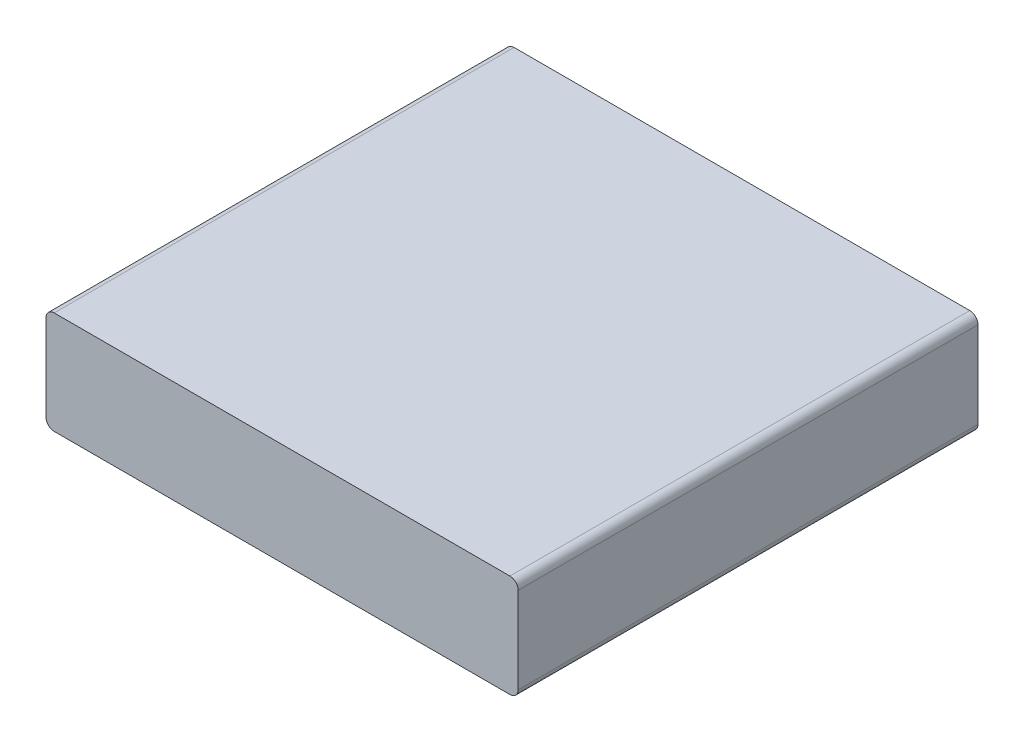
ISO-10303-21;
HEADER;
FILE_DESCRIPTION(('STEP AP214'),'2;1');
FILE_NAME('part.step','',(''),(''),'','','');
FILE_SCHEMA(('AUTOMOTIVE_DESIGN { 1 0 10303 214 1 1 1 1 }'));
ENDSEC;
DATA;
#1=APPLICATION_CONTEXT('core data for automotive mechanical design processes');
#2=APPLICATION_PROTOCOL_DEFINITION('international standard','automotive_design',2000,#1);
#3=PRODUCT_CONTEXT('',#1,'mechanical');
#4=PRODUCT('Part','Part','',(#3));
#5=PRODUCT_RELATED_PRODUCT_CATEGORY('part','',(#4));
#6=PRODUCT_DEFINITION_FORMATION('','',#4);
#7=PRODUCT_DEFINITION_CONTEXT('part definition',#1,'design');
#8=PRODUCT_DEFINITION('design','',#6,#7);
#9=PRODUCT_DEFINITION_SHAPE('','',#8);
#10=(LENGTH_UNIT() NAMED_UNIT(*) SI_UNIT(.MILLI.,.METRE.));
#11=(NAMED_UNIT(*) PLANE_ANGLE_UNIT() SI_UNIT($,.RADIAN.));
#12=(NAMED_UNIT(*) SI_UNIT($,.STERADIAN.) SOLID_ANGLE_UNIT());
#13=UNCERTAINTY_MEASURE_WITH_UNIT(LENGTH_MEASURE(1.E-05),#10,'distance_accuracy_value','');
#14=(GEOMETRIC_REPRESENTATION_CONTEXT(3) GLOBAL_UNCERTAINTY_ASSIGNED_CONTEXT((#13)) GLOBAL_UNIT_ASSIGNED_CONTEXT((#10,
#11,#12)) REPRESENTATION_CONTEXT('',''));
#15=CARTESIAN_POINT('',(0.,0.,0.));
#16=DIRECTION('',(0.,0.,1.));
#17=DIRECTION('',(1.,0.,0.));
#18=AXIS2_PLACEMENT_3D('',#15,#16,#17);
#19=CARTESIAN_POINT('',(-29.3402777777778,15.8854166666667,-112.));
#20=DIRECTION('',(-1.,0.,0.));
#21=DIRECTION('',(0.,0.,1.));
#22=AXIS2_PLACEMENT_3D('',#19,#20,#21);
#23=PLANE('',#22);
#24=DIRECTION('',(0.,-1.,0.));
#25=VECTOR('',#24,1.);
#26=CARTESIAN_POINT('',(-29.3402777777778,15.8854166666667,-112.));
#27=LINE('',#26,#25);
#28=CARTESIAN_POINT('',(-29.3402777777778,13.8854166666667,-112.));
#29=VERTEX_POINT('',#28);
#30=CARTESIAN_POINT('',(-29.3402777777778,-7.11458333333333,-112.));
#31=VERTEX_POINT('',#30);
#32=EDGE_CURVE('E179',#29,#31,#27,.T.);
#33=ORIENTED_EDGE('',*,*,#32,.T.);
#34=DIRECTION('',(0.,0.,1.));
#35=VECTOR('',#34,1.);
#36=CARTESIAN_POINT('',(-29.3402777777778,-7.11458333333333,-112.));
#37=LINE('',#36,#35);
#38=CARTESIAN_POINT('',(-29.3402777777778,-7.11458333333333,0.));
#39=VERTEX_POINT('',#38);
#40=EDGE_CURVE('E11',#31,#39,#37,.T.);
#41=ORIENTED_EDGE('',*,*,#40,.T.);
#42=DIRECTION('',(0.,-1.,0.));
#43=VECTOR('',#42,1.);
#44=CARTESIAN_POINT('',(-29.3402777777778,15.8854166666667,0.));
#45=LINE('',#44,#43);
#46=CARTESIAN_POINT('',(-29.3402777777778,13.8854166666667,0.));
#47=VERTEX_POINT('',#46);
#48=EDGE_CURVE('E112',#47,#39,#45,.T.);
#49=ORIENTED_EDGE('',*,*,#48,.F.);
#50=DIRECTION('',(0.,0.,1.));
#51=VECTOR('',#50,1.);
#52=CARTESIAN_POINT('',(-29.3402777777778,13.8854166666667,-112.));
#53=LINE('',#52,#51);
#54=EDGE_CURVE('E48',#47,#29,#53,.F.);
#55=ORIENTED_EDGE('',*,*,#54,.T.);
#56=EDGE_LOOP('',(#33,#41,#49,#55));
#57=FACE_BOUND('',#56,.T.);
#58=ADVANCED_FACE('F39',(#57),#23,.T.);
#59=CARTESIAN_POINT('',(-29.3402777777778,15.8854166666667,-112.));
#60=DIRECTION('',(0.,1.,0.));
#61=DIRECTION('',(0.,0.,1.));
#62=AXIS2_PLACEMENT_3D('',#59,#60,#61);
#63=PLANE('',#62);
#64=DIRECTION('',(-1.,0.,0.));
#65=VECTOR('',#64,1.);
#66=CARTESIAN_POINT('',(-29.3402777777778,15.8854166666667,0.));
#67=LINE('',#66,#65);
#68=CARTESIAN_POINT('',(83.6597222222222,15.8854166666667,0.));
#69=VERTEX_POINT('',#68);
#70=CARTESIAN_POINT('',(-27.3402777777778,15.8854166666667,0.));
#71=VERTEX_POINT('',#70);
#72=EDGE_CURVE('E143',#69,#71,#67,.T.);
#73=ORIENTED_EDGE('',*,*,#72,.F.);
#74=DIRECTION('',(0.,0.,1.));
#75=VECTOR('',#74,1.);
#76=CARTESIAN_POINT('',(83.6597222222222,15.8854166666667,-112.));
#77=LINE('',#76,#75);
#78=CARTESIAN_POINT('',(83.6597222222222,15.8854166666667,-112.));
#79=VERTEX_POINT('',#78);
#80=EDGE_CURVE('E62',#69,#79,#77,.F.);
#81=ORIENTED_EDGE('',*,*,#80,.T.);
#82=DIRECTION('',(-1.,0.,0.));
#83=VECTOR('',#82,1.);
#84=CARTESIAN_POINT('',(-29.3402777777778,15.8854166666667,-112.));
#85=LINE('',#84,#83);
#86=CARTESIAN_POINT('',(-27.3402777777778,15.8854166666667,-112.));
#87=VERTEX_POINT('',#86);
#88=EDGE_CURVE('E135',#79,#87,#85,.T.);
#89=ORIENTED_EDGE('',*,*,#88,.T.);
#90=DIRECTION('',(0.,0.,1.));
#91=VECTOR('',#90,1.);
#92=CARTESIAN_POINT('',(-27.3402777777778,15.8854166666667,-112.));
#93=LINE('',#92,#91);
#94=EDGE_CURVE('E170',#87,#71,#93,.T.);
#95=ORIENTED_EDGE('',*,*,#94,.T.);
#96=EDGE_LOOP('',(#73,#81,#89,#95));
#97=FACE_BOUND('',#96,.T.);
#98=ADVANCED_FACE('F188',(#97),#63,.T.);
#99=CARTESIAN_POINT('',(85.6597222222222,15.8854166666667,-112.));
#100=DIRECTION('',(1.,0.,0.));
#101=DIRECTION('',(0.,0.,-1.));
#102=AXIS2_PLACEMENT_3D('',#99,#100,#101);
#103=PLANE('',#102);
#104=DIRECTION('',(0.,1.,0.));
#105=VECTOR('',#104,1.);
#106=CARTESIAN_POINT('',(85.6597222222222,15.8854166666667,0.));
#107=LINE('',#106,#105);
#108=CARTESIAN_POINT('',(85.6597222222222,-7.11458333333333,0.));
#109=VERTEX_POINT('',#108);
#110=CARTESIAN_POINT('',(85.6597222222222,13.8854166666667,0.));
#111=VERTEX_POINT('',#110);
#112=EDGE_CURVE('E129',#109,#111,#107,.T.);
#113=ORIENTED_EDGE('',*,*,#112,.F.);
#114=DIRECTION('',(0.,0.,1.));
#115=VECTOR('',#114,1.);
#116=CARTESIAN_POINT('',(85.6597222222222,-7.11458333333333,-112.));
#117=LINE('',#116,#115);
#118=CARTESIAN_POINT('',(85.6597222222222,-7.11458333333333,-112.));
#119=VERTEX_POINT('',#118);
#120=EDGE_CURVE('E157',#109,#119,#117,.F.);
#121=ORIENTED_EDGE('',*,*,#120,.T.);
#122=DIRECTION('',(0.,1.,0.));
#123=VECTOR('',#122,1.);
#124=CARTESIAN_POINT('',(85.6597222222222,15.8854166666667,-112.));
#125=LINE('',#124,#123);
#126=CARTESIAN_POINT('',(85.6597222222222,13.8854166666667,-112.));
#127=VERTEX_POINT('',#126);
#128=EDGE_CURVE('E140',#119,#127,#125,.T.);
#129=ORIENTED_EDGE('',*,*,#128,.T.);
#130=DIRECTION('',(0.,0.,1.));
#131=VECTOR('',#130,1.);
#132=CARTESIAN_POINT('',(85.6597222222222,13.8854166666667,-112.));
#133=LINE('',#132,#131);
#134=EDGE_CURVE('E153',#127,#111,#133,.T.);
#135=ORIENTED_EDGE('',*,*,#134,.T.);
#136=EDGE_LOOP('',(#113,#121,#129,#135));
#137=FACE_BOUND('',#136,.T.);
#138=ADVANCED_FACE('F205',(#137),#103,.T.);
#139=CARTESIAN_POINT('',(-29.3402777777778,-9.11458333333333,-112.));
#140=DIRECTION('',(0.,-1.,0.));
#141=DIRECTION('',(0.,0.,-1.));
#142=AXIS2_PLACEMENT_3D('',#139,#140,#141);
#143=PLANE('',#142);
#144=DIRECTION('',(1.,0.,0.));
#145=VECTOR('',#144,1.);
#146=CARTESIAN_POINT('',(-29.3402777777778,-9.11458333333333,-112.));
#147=LINE('',#146,#145);
#148=CARTESIAN_POINT('',(-27.3402777777778,-9.11458333333333,-112.));
#149=VERTEX_POINT('',#148);
#150=CARTESIAN_POINT('',(83.6597222222222,-9.11458333333333,-112.));
#151=VERTEX_POINT('',#150);
#152=EDGE_CURVE('E184',#149,#151,#147,.T.);
#153=ORIENTED_EDGE('',*,*,#152,.T.);
#154=DIRECTION('',(0.,0.,1.));
#155=VECTOR('',#154,1.);
#156=CARTESIAN_POINT('',(83.6597222222222,-9.11458333333333,-112.));
#157=LINE('',#156,#155);
#158=CARTESIAN_POINT('',(83.6597222222222,-9.11458333333333,0.));
#159=VERTEX_POINT('',#158);
#160=EDGE_CURVE('E127',#151,#159,#157,.T.);
#161=ORIENTED_EDGE('',*,*,#160,.T.);
#162=DIRECTION('',(1.,0.,0.));
#163=VECTOR('',#162,1.);
#164=CARTESIAN_POINT('',(-29.3402777777778,-9.11458333333333,0.));
#165=LINE('',#164,#163);
#166=CARTESIAN_POINT('',(-27.3402777777778,-9.11458333333333,0.));
#167=VERTEX_POINT('',#166);
#168=EDGE_CURVE('E110',#167,#159,#165,.T.);
#169=ORIENTED_EDGE('',*,*,#168,.F.);
#170=DIRECTION('',(0.,0.,1.));
#171=VECTOR('',#170,1.);
#172=CARTESIAN_POINT('',(-27.3402777777778,-9.11458333333333,-112.));
#173=LINE('',#172,#171);
#174=EDGE_CURVE('E124',#167,#149,#173,.F.);
#175=ORIENTED_EDGE('',*,*,#174,.T.);
#176=EDGE_LOOP('',(#153,#161,#169,#175));
#177=FACE_BOUND('',#176,.T.);
#178=ADVANCED_FACE('F123',(#177),#143,.T.);
#179=CARTESIAN_POINT('',(0.,0.,-112.));
#180=DIRECTION('',(0.,0.,1.));
#181=DIRECTION('',(1.,0.,0.));
#182=AXIS2_PLACEMENT_3D('',#179,#180,#181);
#183=PLANE('',#182);
#184=ORIENTED_EDGE('',*,*,#128,.F.);
#185=CARTESIAN_POINT('',(83.6597222222222,-7.11458333333333,-112.));
#186=DIRECTION('',(0.,0.,1.));
#187=DIRECTION('',(1.,0.,0.));
#188=AXIS2_PLACEMENT_3D('',#185,#186,#187);
#189=CIRCLE('',#188,2.);
#190=EDGE_CURVE('E167',#119,#151,#189,.F.);
#191=ORIENTED_EDGE('',*,*,#190,.T.);
#192=ORIENTED_EDGE('',*,*,#152,.F.);
#193=CARTESIAN_POINT('',(-27.3402777777778,-7.11458333333333,-112.));
#194=DIRECTION('',(0.,0.,1.));
#195=DIRECTION('',(1.,0.,0.));
#196=AXIS2_PLACEMENT_3D('',#193,#194,#195);
#197=CIRCLE('',#196,2.);
#198=EDGE_CURVE('E133',#149,#31,#197,.F.);
#199=ORIENTED_EDGE('',*,*,#198,.T.);
#200=ORIENTED_EDGE('',*,*,#32,.F.);
#201=CARTESIAN_POINT('',(-27.3402777777778,13.8854166666667,-112.));
#202=DIRECTION('',(0.,0.,1.));
#203=DIRECTION('',(1.,0.,0.));
#204=AXIS2_PLACEMENT_3D('',#201,#202,#203);
#205=CIRCLE('',#204,2.);
#206=EDGE_CURVE('E55',#29,#87,#205,.F.);
#207=ORIENTED_EDGE('',*,*,#206,.T.);
#208=ORIENTED_EDGE('',*,*,#88,.F.);
#209=CARTESIAN_POINT('',(83.6597222222222,13.8854166666667,-112.));
#210=DIRECTION('',(0.,0.,1.));
#211=DIRECTION('',(1.,0.,0.));
#212=AXIS2_PLACEMENT_3D('',#209,#210,#211);
#213=CIRCLE('',#212,2.);
#214=EDGE_CURVE('E164',#79,#127,#213,.F.);
#215=ORIENTED_EDGE('',*,*,#214,.T.);
#216=EDGE_LOOP('',(#184,#191,#192,#199,#200,#207,#208,#215));
#217=FACE_BOUND('',#216,.T.);
#218=ADVANCED_FACE('F182',(#217),#183,.F.);
#219=CARTESIAN_POINT('',(0.,0.,0.));
#220=DIRECTION('',(0.,0.,1.));
#221=DIRECTION('',(1.,0.,0.));
#222=AXIS2_PLACEMENT_3D('',#219,#220,#221);
#223=PLANE('',#222);
#224=ORIENTED_EDGE('',*,*,#168,.T.);
#225=CARTESIAN_POINT('',(83.6597222222222,-7.11458333333333,0.));
#226=DIRECTION('',(0.,0.,1.));
#227=DIRECTION('',(1.,0.,0.));
#228=AXIS2_PLACEMENT_3D('',#225,#226,#227);
#229=CIRCLE('',#228,2.);
#230=EDGE_CURVE('E150',#159,#109,#229,.T.);
#231=ORIENTED_EDGE('',*,*,#230,.T.);
#232=ORIENTED_EDGE('',*,*,#112,.T.);
#233=CARTESIAN_POINT('',(83.6597222222222,13.8854166666667,0.));
#234=DIRECTION('',(0.,0.,1.));
#235=DIRECTION('',(1.,0.,0.));
#236=AXIS2_PLACEMENT_3D('',#233,#234,#235);
#237=CIRCLE('',#236,2.);
#238=EDGE_CURVE('E117',#111,#69,#237,.T.);
#239=ORIENTED_EDGE('',*,*,#238,.T.);
#240=ORIENTED_EDGE('',*,*,#72,.T.);
#241=CARTESIAN_POINT('',(-27.3402777777778,13.8854166666667,0.));
#242=DIRECTION('',(0.,0.,1.));
#243=DIRECTION('',(1.,0.,0.));
#244=AXIS2_PLACEMENT_3D('',#241,#242,#243);
#245=CIRCLE('',#244,2.);
#246=EDGE_CURVE('E118',#71,#47,#245,.T.);
#247=ORIENTED_EDGE('',*,*,#246,.T.);
#248=ORIENTED_EDGE('',*,*,#48,.T.);
#249=CARTESIAN_POINT('',(-27.3402777777778,-7.11458333333333,0.));
#250=DIRECTION('',(0.,0.,1.));
#251=DIRECTION('',(1.,0.,0.));
#252=AXIS2_PLACEMENT_3D('',#249,#250,#251);
#253=CIRCLE('',#252,2.);
#254=EDGE_CURVE('E107',#39,#167,#253,.T.);
#255=ORIENTED_EDGE('',*,*,#254,.T.);
#256=EDGE_LOOP('',(#224,#231,#232,#239,#240,#247,#248,#255));
#257=FACE_BOUND('',#256,.T.);
#258=ADVANCED_FACE('F109',(#257),#223,.T.);
#259=CARTESIAN_POINT('',(83.6597222222222,-7.11458333333333,-112.));
#260=DIRECTION('',(0.,0.,1.));
#261=DIRECTION('',(1.,0.,0.));
#262=AXIS2_PLACEMENT_3D('',#259,#260,#261);
#263=CYLINDRICAL_SURFACE('',#262,2.);
#264=ORIENTED_EDGE('',*,*,#190,.F.);
#265=ORIENTED_EDGE('',*,*,#120,.F.);
#266=ORIENTED_EDGE('',*,*,#230,.F.);
#267=ORIENTED_EDGE('',*,*,#160,.F.);
#268=EDGE_LOOP('',(#264,#265,#266,#267));
#269=FACE_BOUND('',#268,.T.);
#270=ADVANCED_FACE('F202',(#269),#263,.T.);
#271=CARTESIAN_POINT('',(83.6597222222222,13.8854166666667,-112.));
#272=DIRECTION('',(0.,0.,1.));
#273=DIRECTION('',(1.,0.,0.));
#274=AXIS2_PLACEMENT_3D('',#271,#272,#273);
#275=CYLINDRICAL_SURFACE('',#274,2.);
#276=ORIENTED_EDGE('',*,*,#214,.F.);
#277=ORIENTED_EDGE('',*,*,#80,.F.);
#278=ORIENTED_EDGE('',*,*,#238,.F.);
#279=ORIENTED_EDGE('',*,*,#134,.F.);
#280=EDGE_LOOP('',(#276,#277,#278,#279));
#281=FACE_BOUND('',#280,.T.);
#282=ADVANCED_FACE('F209',(#281),#275,.T.);
#283=CARTESIAN_POINT('',(-27.3402777777778,-7.11458333333333,-112.));
#284=DIRECTION('',(0.,0.,1.));
#285=DIRECTION('',(1.,0.,0.));
#286=AXIS2_PLACEMENT_3D('',#283,#284,#285);
#287=CYLINDRICAL_SURFACE('',#286,2.);
#288=ORIENTED_EDGE('',*,*,#198,.F.);
#289=ORIENTED_EDGE('',*,*,#174,.F.);
#290=ORIENTED_EDGE('',*,*,#254,.F.);
#291=ORIENTED_EDGE('',*,*,#40,.F.);
#292=EDGE_LOOP('',(#288,#289,#290,#291));
#293=FACE_BOUND('',#292,.T.);
#294=ADVANCED_FACE('F132',(#293),#287,.T.);
#295=CARTESIAN_POINT('',(-27.3402777777778,13.8854166666667,-112.));
#296=DIRECTION('',(0.,0.,1.));
#297=DIRECTION('',(1.,0.,0.));
#298=AXIS2_PLACEMENT_3D('',#295,#296,#297);
#299=CYLINDRICAL_SURFACE('',#298,2.);
#300=ORIENTED_EDGE('',*,*,#206,.F.);
#301=ORIENTED_EDGE('',*,*,#54,.F.);
#302=ORIENTED_EDGE('',*,*,#246,.F.);
#303=ORIENTED_EDGE('',*,*,#94,.F.);
#304=EDGE_LOOP('',(#300,#301,#302,#303));
#305=FACE_BOUND('',#304,.T.);
#306=ADVANCED_FACE('F41',(#305),#299,.T.);
#307=CLOSED_SHELL('',(#58,#98,#138,#178,#218,#258,#270,#282,#294,#306));
#308=MANIFOLD_SOLID_BREP('B2',#307);
#309=ADVANCED_BREP_SHAPE_REPRESENTATION('',(#18,#308),#14);
#310=SHAPE_DEFINITION_REPRESENTATION(#9,#309);
ENDSEC;
END-ISO-10303-21;
